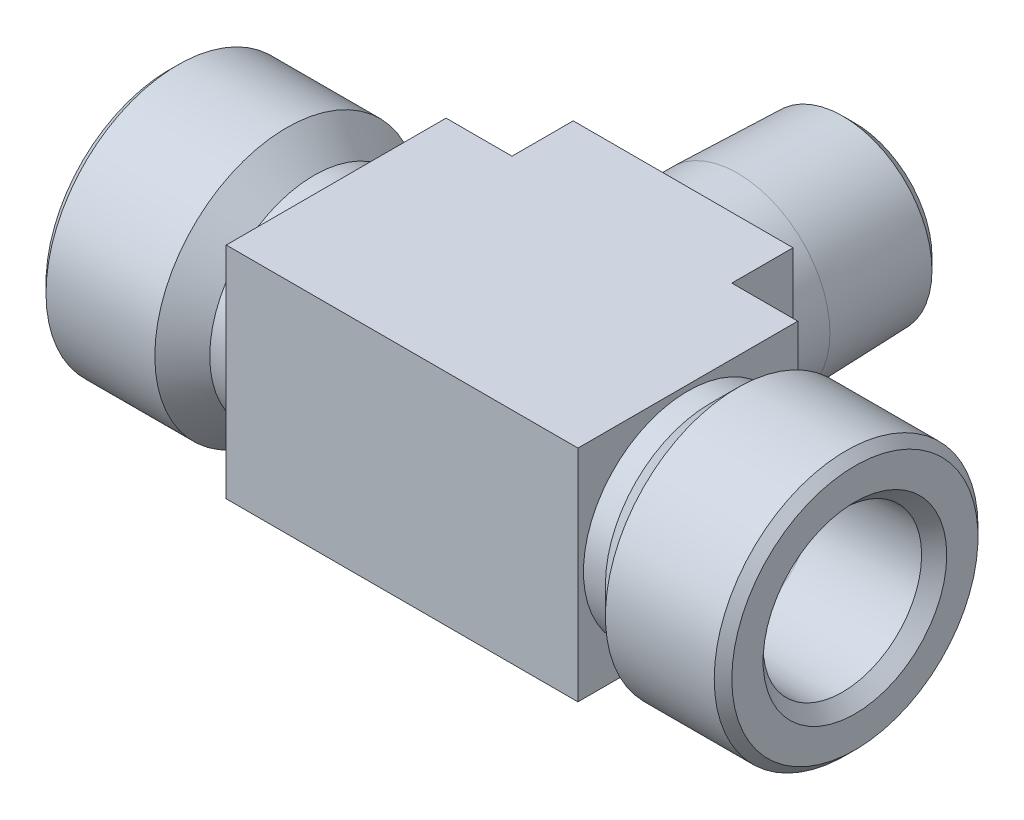
ISO-10303-21;
HEADER;
FILE_DESCRIPTION(('STEP AP214'),'2;1');
FILE_NAME('part.step','',(''),(''),'','','');
FILE_SCHEMA(('AUTOMOTIVE_DESIGN { 1 0 10303 214 1 1 1 1 }'));
ENDSEC;
DATA;
#1=APPLICATION_CONTEXT('core data for automotive mechanical design processes');
#2=APPLICATION_PROTOCOL_DEFINITION('international standard','automotive_design',2000,#1);
#3=PRODUCT_CONTEXT('',#1,'mechanical');
#4=PRODUCT('Part','Part','',(#3));
#5=PRODUCT_RELATED_PRODUCT_CATEGORY('part','',(#4));
#6=PRODUCT_DEFINITION_FORMATION('','',#4);
#7=PRODUCT_DEFINITION_CONTEXT('part definition',#1,'design');
#8=PRODUCT_DEFINITION('design','',#6,#7);
#9=PRODUCT_DEFINITION_SHAPE('','',#8);
#10=(LENGTH_UNIT() NAMED_UNIT(*) SI_UNIT(.MILLI.,.METRE.));
#11=(NAMED_UNIT(*) PLANE_ANGLE_UNIT() SI_UNIT($,.RADIAN.));
#12=(NAMED_UNIT(*) SI_UNIT($,.STERADIAN.) SOLID_ANGLE_UNIT());
#13=UNCERTAINTY_MEASURE_WITH_UNIT(LENGTH_MEASURE(1.E-05),#10,'distance_accuracy_value','');
#14=(GEOMETRIC_REPRESENTATION_CONTEXT(3) GLOBAL_UNCERTAINTY_ASSIGNED_CONTEXT((#13)) GLOBAL_UNIT_ASSIGNED_CONTEXT((#10,
#11,#12)) REPRESENTATION_CONTEXT('',''));
#15=CARTESIAN_POINT('',(0.,0.,0.));
#16=DIRECTION('',(0.,0.,1.));
#17=DIRECTION('',(1.,0.,0.));
#18=AXIS2_PLACEMENT_3D('',#15,#16,#17);
#19=CARTESIAN_POINT('',(19.304,12.7,-12.7));
#20=DIRECTION('',(0.,0.,-1.));
#21=DIRECTION('',(-1.,0.,0.));
#22=AXIS2_PLACEMENT_3D('',#19,#20,#21);
#23=PLANE('',#22);
#24=DIRECTION('',(0.,1.,0.));
#25=VECTOR('',#24,1.);
#26=CARTESIAN_POINT('',(19.304,0.,-12.7));
#27=LINE('',#26,#25);
#28=CARTESIAN_POINT('',(19.304,12.7,-12.7));
#29=VERTEX_POINT('',#28);
#30=CARTESIAN_POINT('',(19.304,-12.7,-12.7));
#31=VERTEX_POINT('',#30);
#32=EDGE_CURVE('E123',#29,#31,#27,.F.);
#33=ORIENTED_EDGE('',*,*,#32,.F.);
#34=DIRECTION('',(1.,0.,0.));
#35=VECTOR('',#34,1.);
#36=CARTESIAN_POINT('',(19.304,12.7,-12.7));
#37=LINE('',#36,#35);
#38=CARTESIAN_POINT('',(26.924,12.7,-12.7));
#39=VERTEX_POINT('',#38);
#40=EDGE_CURVE('E208',#39,#29,#37,.F.);
#41=ORIENTED_EDGE('',*,*,#40,.F.);
#42=DIRECTION('',(0.,1.,0.));
#43=VECTOR('',#42,1.);
#44=CARTESIAN_POINT('',(26.924,12.7,-12.7));
#45=LINE('',#44,#43);
#46=CARTESIAN_POINT('',(26.924,-12.7,-12.7));
#47=VERTEX_POINT('',#46);
#48=EDGE_CURVE('E210',#47,#39,#45,.T.);
#49=ORIENTED_EDGE('',*,*,#48,.F.);
#50=DIRECTION('',(1.,0.,0.));
#51=VECTOR('',#50,1.);
#52=CARTESIAN_POINT('',(19.304,-12.7,-12.7));
#53=LINE('',#52,#51);
#54=EDGE_CURVE('E215',#31,#47,#53,.T.);
#55=ORIENTED_EDGE('',*,*,#54,.F.);
#56=EDGE_LOOP('',(#33,#41,#49,#55));
#57=FACE_BOUND('',#56,.T.);
#58=ADVANCED_FACE('F16',(#57),#23,.T.);
#59=CARTESIAN_POINT('',(19.304,0.,-6.35));
#60=DIRECTION('',(-1.,0.,0.));
#61=DIRECTION('',(0.,0.,1.));
#62=AXIS2_PLACEMENT_3D('',#59,#60,#61);
#63=PLANE('',#62);
#64=DIRECTION('',(0.,0.,1.));
#65=VECTOR('',#64,1.);
#66=CARTESIAN_POINT('',(19.304,12.7,12.7));
#67=LINE('',#66,#65);
#68=CARTESIAN_POINT('',(19.304,12.7,12.7));
#69=VERTEX_POINT('',#68);
#70=EDGE_CURVE('E206',#29,#69,#67,.T.);
#71=ORIENTED_EDGE('',*,*,#70,.F.);
#72=ORIENTED_EDGE('',*,*,#32,.T.);
#73=DIRECTION('',(0.,0.,1.));
#74=VECTOR('',#73,1.);
#75=CARTESIAN_POINT('',(19.304,-12.7,-12.7));
#76=LINE('',#75,#74);
#77=CARTESIAN_POINT('',(19.304,-12.7,12.7));
#78=VERTEX_POINT('',#77);
#79=EDGE_CURVE('E108',#78,#31,#76,.F.);
#80=ORIENTED_EDGE('',*,*,#79,.F.);
#81=DIRECTION('',(0.,-1.,0.));
#82=VECTOR('',#81,1.);
#83=CARTESIAN_POINT('',(19.304,-12.7,12.7));
#84=LINE('',#83,#82);
#85=EDGE_CURVE('E121',#69,#78,#84,.T.);
#86=ORIENTED_EDGE('',*,*,#85,.F.);
#87=EDGE_LOOP('',(#71,#72,#80,#86));
#88=FACE_BOUND('',#87,.T.);
#89=CARTESIAN_POINT('',(19.304,0.,0.));
#90=DIRECTION('',(-1.,0.,0.));
#91=DIRECTION('',(0.,0.,1.));
#92=AXIS2_PLACEMENT_3D('',#89,#90,#91);
#93=CIRCLE('',#92,12.065);
#94=CARTESIAN_POINT('',(19.304,0.,12.065));
#95=VERTEX_POINT('',#94);
#96=EDGE_CURVE('E102',#95,#95,#93,.T.);
#97=ORIENTED_EDGE('',*,*,#96,.F.);
#98=EDGE_LOOP('',(#97));
#99=FACE_BOUND('',#98,.T.);
#100=ADVANCED_FACE('F279',(#88,#99),#63,.T.);
#101=CARTESIAN_POINT('',(19.304,-12.7,12.7));
#102=DIRECTION('',(0.,0.,1.));
#103=DIRECTION('',(0.,-1.,0.));
#104=AXIS2_PLACEMENT_3D('',#101,#102,#103);
#105=PLANE('',#104);
#106=DIRECTION('',(0.,1.,0.));
#107=VECTOR('',#106,1.);
#108=CARTESIAN_POINT('',(59.944,0.,12.7));
#109=LINE('',#108,#107);
#110=CARTESIAN_POINT('',(59.944,12.7,12.7));
#111=VERTEX_POINT('',#110);
#112=CARTESIAN_POINT('',(59.944,-12.7,12.7));
#113=VERTEX_POINT('',#112);
#114=EDGE_CURVE('E79',#111,#113,#109,.F.);
#115=ORIENTED_EDGE('',*,*,#114,.F.);
#116=DIRECTION('',(1.,0.,0.));
#117=VECTOR('',#116,1.);
#118=CARTESIAN_POINT('',(19.304,12.7,12.7));
#119=LINE('',#118,#117);
#120=EDGE_CURVE('E204',#69,#111,#119,.T.);
#121=ORIENTED_EDGE('',*,*,#120,.F.);
#122=ORIENTED_EDGE('',*,*,#85,.T.);
#123=DIRECTION('',(1.,0.,0.));
#124=VECTOR('',#123,1.);
#125=CARTESIAN_POINT('',(19.304,-12.7,12.7));
#126=LINE('',#125,#124);
#127=EDGE_CURVE('E106',#113,#78,#126,.F.);
#128=ORIENTED_EDGE('',*,*,#127,.F.);
#129=EDGE_LOOP('',(#115,#121,#122,#128));
#130=FACE_BOUND('',#129,.T.);
#131=ADVANCED_FACE('F277',(#130),#105,.T.);
#132=CARTESIAN_POINT('',(59.944,0.,-6.35));
#133=DIRECTION('',(1.,0.,0.));
#134=DIRECTION('',(0.,1.,0.));
#135=AXIS2_PLACEMENT_3D('',#132,#133,#134);
#136=PLANE('',#135);
#137=DIRECTION('',(0.,0.,1.));
#138=VECTOR('',#137,1.);
#139=CARTESIAN_POINT('',(59.944,-12.7,-12.7));
#140=LINE('',#139,#138);
#141=CARTESIAN_POINT('',(59.944,-12.7,-12.7));
#142=VERTEX_POINT('',#141);
#143=EDGE_CURVE('E98',#142,#113,#140,.T.);
#144=ORIENTED_EDGE('',*,*,#143,.F.);
#145=DIRECTION('',(0.,1.,0.));
#146=VECTOR('',#145,1.);
#147=CARTESIAN_POINT('',(59.944,12.7,-12.7));
#148=LINE('',#147,#146);
#149=CARTESIAN_POINT('',(59.944,12.7,-12.7));
#150=VERTEX_POINT('',#149);
#151=EDGE_CURVE('E86',#150,#142,#148,.F.);
#152=ORIENTED_EDGE('',*,*,#151,.F.);
#153=DIRECTION('',(0.,0.,1.));
#154=VECTOR('',#153,1.);
#155=CARTESIAN_POINT('',(59.944,12.7,12.7));
#156=LINE('',#155,#154);
#157=EDGE_CURVE('E202',#111,#150,#156,.F.);
#158=ORIENTED_EDGE('',*,*,#157,.F.);
#159=ORIENTED_EDGE('',*,*,#114,.T.);
#160=EDGE_LOOP('',(#144,#152,#158,#159));
#161=FACE_BOUND('',#160,.T.);
#162=CARTESIAN_POINT('',(59.944,0.,0.));
#163=DIRECTION('',(1.,0.,0.));
#164=DIRECTION('',(0.,0.,-1.));
#165=AXIS2_PLACEMENT_3D('',#162,#163,#164);
#166=CIRCLE('',#165,12.065);
#167=CARTESIAN_POINT('',(59.944,0.,-12.065));
#168=VERTEX_POINT('',#167);
#169=EDGE_CURVE('E19',#168,#168,#166,.T.);
#170=ORIENTED_EDGE('',*,*,#169,.F.);
#171=EDGE_LOOP('',(#170));
#172=FACE_BOUND('',#171,.T.);
#173=ADVANCED_FACE('F104',(#161,#172),#136,.T.);
#174=CARTESIAN_POINT('',(19.304,12.7,-12.7));
#175=DIRECTION('',(0.,0.,-1.));
#176=DIRECTION('',(-1.,0.,0.));
#177=AXIS2_PLACEMENT_3D('',#174,#175,#176);
#178=PLANE('',#177);
#179=ORIENTED_EDGE('',*,*,#151,.T.);
#180=DIRECTION('',(1.,0.,0.));
#181=VECTOR('',#180,1.);
#182=CARTESIAN_POINT('',(19.304,-12.7,-12.7));
#183=LINE('',#182,#181);
#184=CARTESIAN_POINT('',(52.324,-12.7,-12.7));
#185=VERTEX_POINT('',#184);
#186=EDGE_CURVE('E90',#185,#142,#183,.T.);
#187=ORIENTED_EDGE('',*,*,#186,.F.);
#188=DIRECTION('',(0.,1.,0.));
#189=VECTOR('',#188,1.);
#190=CARTESIAN_POINT('',(52.324,-12.7,-12.7));
#191=LINE('',#190,#189);
#192=CARTESIAN_POINT('',(52.324,12.7,-12.7));
#193=VERTEX_POINT('',#192);
#194=EDGE_CURVE('E196',#193,#185,#191,.F.);
#195=ORIENTED_EDGE('',*,*,#194,.F.);
#196=DIRECTION('',(1.,0.,0.));
#197=VECTOR('',#196,1.);
#198=CARTESIAN_POINT('',(19.304,12.7,-12.7));
#199=LINE('',#198,#197);
#200=EDGE_CURVE('E92',#150,#193,#199,.F.);
#201=ORIENTED_EDGE('',*,*,#200,.F.);
#202=EDGE_LOOP('',(#179,#187,#195,#201));
#203=FACE_BOUND('',#202,.T.);
#204=ADVANCED_FACE('F88',(#203),#178,.T.);
#205=CARTESIAN_POINT('',(61.214,0.,0.));
#206=DIRECTION('',(1.,0.,0.));
#207=DIRECTION('',(0.,0.,-1.));
#208=AXIS2_PLACEMENT_3D('',#205,#206,#207);
#209=CYLINDRICAL_SURFACE('',#208,12.065);
#210=ORIENTED_EDGE('',*,*,#169,.T.);
#211=EDGE_LOOP('',(#210));
#212=FACE_BOUND('',#211,.T.);
#213=CARTESIAN_POINT('',(62.484,0.,0.));
#214=DIRECTION('',(1.,0.,0.));
#215=DIRECTION('',(0.,0.,1.));
#216=AXIS2_PLACEMENT_3D('',#213,#214,#215);
#217=CIRCLE('',#216,12.065);
#218=CARTESIAN_POINT('',(62.484,0.,12.065));
#219=VERTEX_POINT('',#218);
#220=EDGE_CURVE('E116',#219,#219,#217,.F.);
#221=ORIENTED_EDGE('',*,*,#220,.T.);
#222=EDGE_LOOP('',(#221));
#223=FACE_BOUND('',#222,.T.);
#224=ADVANCED_FACE('F268',(#212,#223),#209,.T.);
#225=CARTESIAN_POINT('',(18.034,0.,0.));
#226=DIRECTION('',(-1.,0.,0.));
#227=DIRECTION('',(0.,0.,1.));
#228=AXIS2_PLACEMENT_3D('',#225,#226,#227);
#229=CYLINDRICAL_SURFACE('',#228,12.065);
#230=ORIENTED_EDGE('',*,*,#96,.T.);
#231=EDGE_LOOP('',(#230));
#232=FACE_BOUND('',#231,.T.);
#233=CARTESIAN_POINT('',(16.764,0.,0.));
#234=DIRECTION('',(-1.,0.,0.));
#235=DIRECTION('',(0.,0.,-1.));
#236=AXIS2_PLACEMENT_3D('',#233,#234,#235);
#237=CIRCLE('',#236,12.065);
#238=CARTESIAN_POINT('',(16.764,0.,-12.065));
#239=VERTEX_POINT('',#238);
#240=EDGE_CURVE('E112',#239,#239,#237,.F.);
#241=ORIENTED_EDGE('',*,*,#240,.T.);
#242=EDGE_LOOP('',(#241));
#243=FACE_BOUND('',#242,.T.);
#244=ADVANCED_FACE('F265',(#232,#243),#229,.T.);
#245=CARTESIAN_POINT('',(19.304,-12.7,-12.7));
#246=DIRECTION('',(0.,-1.,0.));
#247=DIRECTION('',(1.,0.,0.));
#248=AXIS2_PLACEMENT_3D('',#245,#246,#247);
#249=PLANE('',#248);
#250=ORIENTED_EDGE('',*,*,#79,.T.);
#251=ORIENTED_EDGE('',*,*,#54,.T.);
#252=DIRECTION('',(0.,0.,1.));
#253=VECTOR('',#252,1.);
#254=CARTESIAN_POINT('',(26.924,-12.7,0.));
#255=LINE('',#254,#253);
#256=CARTESIAN_POINT('',(26.924,-12.7,-19.7739));
#257=VERTEX_POINT('',#256);
#258=EDGE_CURVE('E212',#257,#47,#255,.T.);
#259=ORIENTED_EDGE('',*,*,#258,.F.);
#260=DIRECTION('',(-1.,0.,0.));
#261=VECTOR('',#260,1.);
#262=CARTESIAN_POINT('',(45.974,-12.7,-19.7739));
#263=LINE('',#262,#261);
#264=CARTESIAN_POINT('',(52.324,-12.7,-19.7739));
#265=VERTEX_POINT('',#264);
#266=EDGE_CURVE('E115',#265,#257,#263,.T.);
#267=ORIENTED_EDGE('',*,*,#266,.F.);
#268=DIRECTION('',(0.,0.,-1.));
#269=VECTOR('',#268,1.);
#270=CARTESIAN_POINT('',(52.324,-12.7,0.));
#271=LINE('',#270,#269);
#272=EDGE_CURVE('E101',#185,#265,#271,.T.);
#273=ORIENTED_EDGE('',*,*,#272,.F.);
#274=ORIENTED_EDGE('',*,*,#186,.T.);
#275=ORIENTED_EDGE('',*,*,#143,.T.);
#276=ORIENTED_EDGE('',*,*,#127,.T.);
#277=EDGE_LOOP('',(#250,#251,#259,#267,#273,#274,#275,#276));
#278=FACE_BOUND('',#277,.T.);
#279=ADVANCED_FACE('F96',(#278),#249,.T.);
#280=CARTESIAN_POINT('',(26.924,12.7,0.));
#281=DIRECTION('',(-1.,0.,0.));
#282=DIRECTION('',(0.,0.,1.));
#283=AXIS2_PLACEMENT_3D('',#280,#281,#282);
#284=PLANE('',#283);
#285=ORIENTED_EDGE('',*,*,#48,.T.);
#286=DIRECTION('',(0.,0.,1.));
#287=VECTOR('',#286,1.);
#288=CARTESIAN_POINT('',(26.924,12.7,12.7));
#289=LINE('',#288,#287);
#290=CARTESIAN_POINT('',(26.924,12.7,-19.7739));
#291=VERTEX_POINT('',#290);
#292=EDGE_CURVE('E198',#291,#39,#289,.T.);
#293=ORIENTED_EDGE('',*,*,#292,.F.);
#294=DIRECTION('',(0.,1.,0.));
#295=VECTOR('',#294,1.);
#296=CARTESIAN_POINT('',(26.924,0.,-19.7739));
#297=LINE('',#296,#295);
#298=EDGE_CURVE('E185',#257,#291,#297,.T.);
#299=ORIENTED_EDGE('',*,*,#298,.F.);
#300=ORIENTED_EDGE('',*,*,#258,.T.);
#301=EDGE_LOOP('',(#285,#293,#299,#300));
#302=FACE_BOUND('',#301,.T.);
#303=ADVANCED_FACE('F228',(#302),#284,.T.);
#304=CARTESIAN_POINT('',(19.304,12.7,12.7));
#305=DIRECTION('',(0.,1.,0.));
#306=DIRECTION('',(0.,0.,1.));
#307=AXIS2_PLACEMENT_3D('',#304,#305,#306);
#308=PLANE('',#307);
#309=DIRECTION('',(-1.,0.,0.));
#310=VECTOR('',#309,1.);
#311=CARTESIAN_POINT('',(45.974,12.7,-19.7739));
#312=LINE('',#311,#310);
#313=CARTESIAN_POINT('',(52.324,12.7,-19.7739));
#314=VERTEX_POINT('',#313);
#315=EDGE_CURVE('E34',#291,#314,#312,.F.);
#316=ORIENTED_EDGE('',*,*,#315,.F.);
#317=ORIENTED_EDGE('',*,*,#292,.T.);
#318=ORIENTED_EDGE('',*,*,#40,.T.);
#319=ORIENTED_EDGE('',*,*,#70,.T.);
#320=ORIENTED_EDGE('',*,*,#120,.T.);
#321=ORIENTED_EDGE('',*,*,#157,.T.);
#322=ORIENTED_EDGE('',*,*,#200,.T.);
#323=DIRECTION('',(0.,0.,-1.));
#324=VECTOR('',#323,1.);
#325=CARTESIAN_POINT('',(52.324,12.7,0.));
#326=LINE('',#325,#324);
#327=EDGE_CURVE('E118',#314,#193,#326,.F.);
#328=ORIENTED_EDGE('',*,*,#327,.F.);
#329=EDGE_LOOP('',(#316,#317,#318,#319,#320,#321,#322,#328));
#330=FACE_BOUND('',#329,.T.);
#331=ADVANCED_FACE('F231',(#330),#308,.T.);
#332=CARTESIAN_POINT('',(52.324,-12.7,0.));
#333=DIRECTION('',(1.,0.,0.));
#334=DIRECTION('',(0.,0.,-1.));
#335=AXIS2_PLACEMENT_3D('',#332,#333,#334);
#336=PLANE('',#335);
#337=DIRECTION('',(0.,1.,0.));
#338=VECTOR('',#337,1.);
#339=CARTESIAN_POINT('',(52.324,0.,-19.7739));
#340=LINE('',#339,#338);
#341=EDGE_CURVE('E181',#314,#265,#340,.F.);
#342=ORIENTED_EDGE('',*,*,#341,.F.);
#343=ORIENTED_EDGE('',*,*,#327,.T.);
#344=ORIENTED_EDGE('',*,*,#194,.T.);
#345=ORIENTED_EDGE('',*,*,#272,.T.);
#346=EDGE_LOOP('',(#342,#343,#344,#345));
#347=FACE_BOUND('',#346,.T.);
#348=ADVANCED_FACE('F234',(#347),#336,.T.);
#349=CARTESIAN_POINT('',(62.484,0.,0.));
#350=DIRECTION('',(1.,0.,0.));
#351=DIRECTION('',(0.,1.,0.));
#352=AXIS2_PLACEMENT_3D('',#349,#350,#351);
#353=CONICAL_SURFACE('',#352,12.065,0.785398163397448);
#354=ORIENTED_EDGE('',*,*,#220,.F.);
#355=EDGE_LOOP('',(#354));
#356=FACE_BOUND('',#355,.T.);
#357=CARTESIAN_POINT('',(65.659,0.,0.));
#358=DIRECTION('',(1.,0.,0.));
#359=DIRECTION('',(0.,0.,-1.));
#360=AXIS2_PLACEMENT_3D('',#357,#358,#359);
#361=CIRCLE('',#360,15.24);
#362=CARTESIAN_POINT('',(65.659,0.,-15.24));
#363=VERTEX_POINT('',#362);
#364=EDGE_CURVE('E183',#363,#363,#361,.T.);
#365=ORIENTED_EDGE('',*,*,#364,.F.);
#366=EDGE_LOOP('',(#365));
#367=FACE_BOUND('',#366,.T.);
#368=ADVANCED_FACE('F248',(#356,#367),#353,.T.);
#369=CARTESIAN_POINT('',(16.764,0.,0.));
#370=DIRECTION('',(-1.,0.,0.));
#371=DIRECTION('',(0.,0.,1.));
#372=AXIS2_PLACEMENT_3D('',#369,#370,#371);
#373=CONICAL_SURFACE('',#372,12.065,0.785398163397448);
#374=ORIENTED_EDGE('',*,*,#240,.F.);
#375=EDGE_LOOP('',(#374));
#376=FACE_BOUND('',#375,.T.);
#377=CARTESIAN_POINT('',(13.589,0.,0.));
#378=DIRECTION('',(-1.,0.,0.));
#379=DIRECTION('',(0.,0.,1.));
#380=AXIS2_PLACEMENT_3D('',#377,#378,#379);
#381=CIRCLE('',#380,15.24);
#382=CARTESIAN_POINT('',(13.589,0.,15.24));
#383=VERTEX_POINT('',#382);
#384=EDGE_CURVE('E188',#383,#383,#381,.T.);
#385=ORIENTED_EDGE('',*,*,#384,.F.);
#386=EDGE_LOOP('',(#385));
#387=FACE_BOUND('',#386,.T.);
#388=ADVANCED_FACE('F238',(#376,#387),#373,.T.);
#389=CARTESIAN_POINT('',(45.974,0.,-19.7739));
#390=DIRECTION('',(0.,0.,-1.));
#391=DIRECTION('',(-1.,0.,0.));
#392=AXIS2_PLACEMENT_3D('',#389,#390,#391);
#393=PLANE('',#392);
#394=CARTESIAN_POINT('',(39.624,0.,-19.7739));
#395=DIRECTION('',(0.,0.,1.));
#396=DIRECTION('',(1.,0.,0.));
#397=AXIS2_PLACEMENT_3D('',#394,#395,#396);
#398=CIRCLE('',#397,10.668);
#399=CARTESIAN_POINT('',(50.292,0.,-19.7739));
#400=VERTEX_POINT('',#399);
#401=EDGE_CURVE('E180',#400,#400,#398,.F.);
#402=ORIENTED_EDGE('',*,*,#401,.F.);
#403=EDGE_LOOP('',(#402));
#404=FACE_BOUND('',#403,.T.);
#405=ORIENTED_EDGE('',*,*,#315,.T.);
#406=ORIENTED_EDGE('',*,*,#341,.T.);
#407=ORIENTED_EDGE('',*,*,#266,.T.);
#408=ORIENTED_EDGE('',*,*,#298,.T.);
#409=EDGE_LOOP('',(#405,#406,#407,#408));
#410=FACE_BOUND('',#409,.T.);
#411=ADVANCED_FACE('F235',(#404,#410),#393,.T.);
#412=CARTESIAN_POINT('',(70.866,0.,0.));
#413=DIRECTION('',(1.,0.,0.));
#414=DIRECTION('',(0.,0.,-1.));
#415=AXIS2_PLACEMENT_3D('',#412,#413,#414);
#416=CYLINDRICAL_SURFACE('',#415,15.24);
#417=ORIENTED_EDGE('',*,*,#364,.T.);
#418=EDGE_LOOP('',(#417));
#419=FACE_BOUND('',#418,.T.);
#420=CARTESIAN_POINT('',(78.232,0.,0.));
#421=DIRECTION('',(-1.,0.,0.));
#422=DIRECTION('',(0.,0.,-1.));
#423=AXIS2_PLACEMENT_3D('',#420,#421,#422);
#424=CIRCLE('',#423,15.24);
#425=CARTESIAN_POINT('',(78.232,0.,-15.24));
#426=VERTEX_POINT('',#425);
#427=EDGE_CURVE('E177',#426,#426,#424,.T.);
#428=ORIENTED_EDGE('',*,*,#427,.T.);
#429=EDGE_LOOP('',(#428));
#430=FACE_BOUND('',#429,.T.);
#431=ADVANCED_FACE('F237',(#419,#430),#416,.T.);
#432=CARTESIAN_POINT('',(8.382,0.,0.));
#433=DIRECTION('',(-1.,0.,0.));
#434=DIRECTION('',(0.,0.,1.));
#435=AXIS2_PLACEMENT_3D('',#432,#433,#434);
#436=CYLINDRICAL_SURFACE('',#435,15.24);
#437=ORIENTED_EDGE('',*,*,#384,.T.);
#438=EDGE_LOOP('',(#437));
#439=FACE_BOUND('',#438,.T.);
#440=CARTESIAN_POINT('',(1.016,0.,0.));
#441=DIRECTION('',(1.,0.,0.));
#442=DIRECTION('',(0.,0.,1.));
#443=AXIS2_PLACEMENT_3D('',#440,#441,#442);
#444=CIRCLE('',#443,15.24);
#445=CARTESIAN_POINT('',(1.016,0.,15.24));
#446=VERTEX_POINT('',#445);
#447=EDGE_CURVE('E174',#446,#446,#444,.T.);
#448=ORIENTED_EDGE('',*,*,#447,.T.);
#449=EDGE_LOOP('',(#448));
#450=FACE_BOUND('',#449,.T.);
#451=ADVANCED_FACE('F245',(#439,#450),#436,.T.);
#452=CARTESIAN_POINT('',(39.624,0.,-22.92096));
#453=DIRECTION('',(0.,0.,1.));
#454=DIRECTION('',(1.,0.,0.));
#455=AXIS2_PLACEMENT_3D('',#452,#453,#454);
#456=CYLINDRICAL_SURFACE('',#455,10.668);
#457=CARTESIAN_POINT('',(39.624,0.,-26.06802));
#458=DIRECTION('',(0.,0.,1.));
#459=DIRECTION('',(-1.,0.,0.));
#460=AXIS2_PLACEMENT_3D('',#457,#458,#459);
#461=CIRCLE('',#460,10.668);
#462=CARTESIAN_POINT('',(28.956,0.,-26.0680199999999));
#463=VERTEX_POINT('',#462);
#464=EDGE_CURVE('E170',#463,#463,#461,.F.);
#465=ORIENTED_EDGE('',*,*,#464,.F.);
#466=EDGE_LOOP('',(#465));
#467=FACE_BOUND('',#466,.T.);
#468=ORIENTED_EDGE('',*,*,#401,.T.);
#469=EDGE_LOOP('',(#468));
#470=FACE_BOUND('',#469,.T.);
#471=ADVANCED_FACE('F322',(#467,#470),#456,.T.);
#472=CARTESIAN_POINT('',(79.248,0.,0.));
#473=DIRECTION('',(-1.,0.,0.));
#474=DIRECTION('',(0.,0.,1.));
#475=AXIS2_PLACEMENT_3D('',#472,#473,#474);
#476=CONICAL_SURFACE('',#475,14.224,0.785398163397448);
#477=CARTESIAN_POINT('',(79.248,0.,0.));
#478=DIRECTION('',(-1.,0.,0.));
#479=DIRECTION('',(0.,0.,1.));
#480=AXIS2_PLACEMENT_3D('',#477,#478,#479);
#481=CIRCLE('',#480,14.224);
#482=CARTESIAN_POINT('',(79.248,0.,14.224));
#483=VERTEX_POINT('',#482);
#484=EDGE_CURVE('E173',#483,#483,#481,.F.);
#485=ORIENTED_EDGE('',*,*,#484,.F.);
#486=EDGE_LOOP('',(#485));
#487=FACE_BOUND('',#486,.T.);
#488=ORIENTED_EDGE('',*,*,#427,.F.);
#489=EDGE_LOOP('',(#488));
#490=FACE_BOUND('',#489,.T.);
#491=ADVANCED_FACE('F325',(#487,#490),#476,.T.);
#492=CARTESIAN_POINT('',(0.,0.,0.));
#493=DIRECTION('',(1.,0.,0.));
#494=DIRECTION('',(0.,0.,-1.));
#495=AXIS2_PLACEMENT_3D('',#492,#493,#494);
#496=CONICAL_SURFACE('',#495,14.224,0.785398163397449);
#497=CARTESIAN_POINT('',(0.,0.,0.));
#498=DIRECTION('',(1.,0.,0.));
#499=DIRECTION('',(0.,0.,-1.));
#500=AXIS2_PLACEMENT_3D('',#497,#498,#499);
#501=CIRCLE('',#500,14.224);
#502=CARTESIAN_POINT('',(0.,0.,-14.224));
#503=VERTEX_POINT('',#502);
#504=EDGE_CURVE('E169',#503,#503,#501,.F.);
#505=ORIENTED_EDGE('',*,*,#504,.F.);
#506=EDGE_LOOP('',(#505));
#507=FACE_BOUND('',#506,.T.);
#508=ORIENTED_EDGE('',*,*,#447,.F.);
#509=EDGE_LOOP('',(#508));
#510=FACE_BOUND('',#509,.T.);
#511=ADVANCED_FACE('F318',(#507,#510),#496,.T.);
#512=CARTESIAN_POINT('',(39.624,0.,-26.0680199999999));
#513=DIRECTION('',(0.,0.,1.));
#514=DIRECTION('',(1.,0.,0.));
#515=AXIS2_PLACEMENT_3D('',#512,#513,#514);
#516=CONICAL_SURFACE('',#515,10.668,0.0311250383214153);
#517=CARTESIAN_POINT('',(39.624,0.,-38.2415334766456));
#518=DIRECTION('',(0.,0.,1.));
#519=DIRECTION('',(-1.,0.,0.));
#520=AXIS2_PLACEMENT_3D('',#517,#518,#519);
#521=CIRCLE('',#520,10.2889765233544);
#522=CARTESIAN_POINT('',(29.3350234766456,0.,-38.2415334766456));
#523=VERTEX_POINT('',#522);
#524=EDGE_CURVE('E165',#523,#523,#521,.T.);
#525=ORIENTED_EDGE('',*,*,#524,.T.);
#526=EDGE_LOOP('',(#525));
#527=FACE_BOUND('',#526,.T.);
#528=ORIENTED_EDGE('',*,*,#464,.T.);
#529=EDGE_LOOP('',(#528));
#530=FACE_BOUND('',#529,.T.);
#531=ADVANCED_FACE('F314',(#527,#530),#516,.T.);
#532=CARTESIAN_POINT('',(79.248,0.,7.62));
#533=DIRECTION('',(1.,0.,0.));
#534=DIRECTION('',(0.,0.,-1.));
#535=AXIS2_PLACEMENT_3D('',#532,#533,#534);
#536=PLANE('',#535);
#537=CARTESIAN_POINT('',(79.248,0.,0.));
#538=DIRECTION('',(1.,0.,0.));
#539=DIRECTION('',(0.,0.,-1.));
#540=AXIS2_PLACEMENT_3D('',#537,#538,#539);
#541=CIRCLE('',#540,10.611739);
#542=CARTESIAN_POINT('',(79.248,0.,-10.611739));
#543=VERTEX_POINT('',#542);
#544=EDGE_CURVE('E168',#543,#543,#541,.F.);
#545=ORIENTED_EDGE('',*,*,#544,.T.);
#546=EDGE_LOOP('',(#545));
#547=FACE_BOUND('',#546,.T.);
#548=ORIENTED_EDGE('',*,*,#484,.T.);
#549=EDGE_LOOP('',(#548));
#550=FACE_BOUND('',#549,.T.);
#551=ADVANCED_FACE('F317',(#547,#550),#536,.T.);
#552=CARTESIAN_POINT('',(0.,0.,-7.62));
#553=DIRECTION('',(-1.,0.,0.));
#554=DIRECTION('',(0.,0.,1.));
#555=AXIS2_PLACEMENT_3D('',#552,#553,#554);
#556=PLANE('',#555);
#557=CARTESIAN_POINT('',(0.,0.,0.));
#558=DIRECTION('',(-1.,0.,0.));
#559=DIRECTION('',(0.,0.,1.));
#560=AXIS2_PLACEMENT_3D('',#557,#558,#559);
#561=CIRCLE('',#560,10.611739);
#562=CARTESIAN_POINT('',(0.,0.,10.611739));
#563=VERTEX_POINT('',#562);
#564=EDGE_CURVE('E298',#563,#563,#561,.F.);
#565=ORIENTED_EDGE('',*,*,#564,.T.);
#566=EDGE_LOOP('',(#565));
#567=FACE_BOUND('',#566,.T.);
#568=ORIENTED_EDGE('',*,*,#504,.T.);
#569=EDGE_LOOP('',(#568));
#570=FACE_BOUND('',#569,.T.);
#571=ADVANCED_FACE('F310',(#567,#570),#556,.T.);
#572=CARTESIAN_POINT('',(39.624,0.,-39.624));
#573=DIRECTION('',(0.,0.,1.));
#574=DIRECTION('',(1.,0.,0.));
#575=AXIS2_PLACEMENT_3D('',#572,#573,#574);
#576=CONICAL_SURFACE('',#575,8.90650999999998,0.785398163397446);
#577=CARTESIAN_POINT('',(39.624,0.,-39.624));
#578=DIRECTION('',(0.,0.,1.));
#579=DIRECTION('',(1.,0.,0.));
#580=AXIS2_PLACEMENT_3D('',#577,#578,#579);
#581=CIRCLE('',#580,8.90650999999999);
#582=CARTESIAN_POINT('',(48.53051,0.,-39.624));
#583=VERTEX_POINT('',#582);
#584=EDGE_CURVE('E164',#583,#583,#581,.F.);
#585=ORIENTED_EDGE('',*,*,#584,.F.);
#586=EDGE_LOOP('',(#585));
#587=FACE_BOUND('',#586,.T.);
#588=ORIENTED_EDGE('',*,*,#524,.F.);
#589=EDGE_LOOP('',(#588));
#590=FACE_BOUND('',#589,.T.);
#591=ADVANCED_FACE('F306',(#587,#590),#576,.T.);
#592=CARTESIAN_POINT('',(79.248,0.,0.));
#593=DIRECTION('',(1.,0.,0.));
#594=DIRECTION('',(0.,0.,-1.));
#595=AXIS2_PLACEMENT_3D('',#592,#593,#594);
#596=CONICAL_SURFACE('',#595,10.611739,0.785398163397448);
#597=ORIENTED_EDGE('',*,*,#544,.F.);
#598=EDGE_LOOP('',(#597));
#599=FACE_BOUND('',#598,.T.);
#600=CARTESIAN_POINT('',(77.796644,0.,0.));
#601=DIRECTION('',(1.,0.,0.));
#602=DIRECTION('',(0.,0.,1.));
#603=AXIS2_PLACEMENT_3D('',#600,#601,#602);
#604=CIRCLE('',#603,9.160383);
#605=CARTESIAN_POINT('',(77.796644,0.,9.160383));
#606=VERTEX_POINT('',#605);
#607=EDGE_CURVE('E161',#606,#606,#604,.F.);
#608=ORIENTED_EDGE('',*,*,#607,.T.);
#609=EDGE_LOOP('',(#608));
#610=FACE_BOUND('',#609,.T.);
#611=ADVANCED_FACE('F309',(#599,#610),#596,.F.);
#612=CARTESIAN_POINT('',(0.,0.,0.));
#613=DIRECTION('',(-1.,0.,0.));
#614=DIRECTION('',(0.,0.,1.));
#615=AXIS2_PLACEMENT_3D('',#612,#613,#614);
#616=CONICAL_SURFACE('',#615,10.611739,0.785398163397449);
#617=ORIENTED_EDGE('',*,*,#564,.F.);
#618=EDGE_LOOP('',(#617));
#619=FACE_BOUND('',#618,.T.);
#620=CARTESIAN_POINT('',(1.45135600000001,0.,0.));
#621=DIRECTION('',(-1.,0.,0.));
#622=DIRECTION('',(0.,0.,-1.));
#623=AXIS2_PLACEMENT_3D('',#620,#621,#622);
#624=CIRCLE('',#623,9.160383);
#625=CARTESIAN_POINT('',(1.45135600000003,0.,-9.160383));
#626=VERTEX_POINT('',#625);
#627=EDGE_CURVE('E157',#626,#626,#624,.F.);
#628=ORIENTED_EDGE('',*,*,#627,.T.);
#629=EDGE_LOOP('',(#628));
#630=FACE_BOUND('',#629,.T.);
#631=ADVANCED_FACE('F346',(#619,#630),#616,.F.);
#632=CARTESIAN_POINT('',(34.5010333503468,0.,-39.624));
#633=DIRECTION('',(0.,0.,-1.));
#634=DIRECTION('',(-1.,0.,0.));
#635=AXIS2_PLACEMENT_3D('',#632,#633,#634);
#636=PLANE('',#635);
#637=ORIENTED_EDGE('',*,*,#584,.T.);
#638=EDGE_LOOP('',(#637));
#639=FACE_BOUND('',#638,.T.);
#640=CARTESIAN_POINT('',(39.624,0.,-39.624));
#641=DIRECTION('',(0.,0.,-1.));
#642=DIRECTION('',(-1.,0.,0.));
#643=AXIS2_PLACEMENT_3D('',#640,#641,#642);
#644=CIRCLE('',#643,5.969);
#645=CARTESIAN_POINT('',(33.655,0.,-39.624));
#646=VERTEX_POINT('',#645);
#647=EDGE_CURVE('E130',#646,#646,#644,.F.);
#648=ORIENTED_EDGE('',*,*,#647,.T.);
#649=EDGE_LOOP('',(#648));
#650=FACE_BOUND('',#649,.T.);
#651=ADVANCED_FACE('F303',(#639,#650),#636,.T.);
#652=CARTESIAN_POINT('',(77.796644,0.,0.));
#653=DIRECTION('',(1.,0.,0.));
#654=DIRECTION('',(0.,1.,0.));
#655=AXIS2_PLACEMENT_3D('',#652,#653,#654);
#656=CONICAL_SURFACE('',#655,9.160383,0.0256563400043167);
#657=ORIENTED_EDGE('',*,*,#607,.F.);
#658=EDGE_LOOP('',(#657));
#659=FACE_BOUND('',#658,.T.);
#660=CARTESIAN_POINT('',(65.67678,0.,0.));
#661=DIRECTION('',(1.,0.,0.));
#662=DIRECTION('',(0.,0.,-1.));
#663=AXIS2_PLACEMENT_3D('',#660,#661,#662);
#664=CIRCLE('',#663,8.84936340276164);
#665=CARTESIAN_POINT('',(65.67678,0.,-8.84936340276164));
#666=VERTEX_POINT('',#665);
#667=EDGE_CURVE('E152',#666,#666,#664,.F.);
#668=ORIENTED_EDGE('',*,*,#667,.T.);
#669=EDGE_LOOP('',(#668));
#670=FACE_BOUND('',#669,.T.);
#671=ADVANCED_FACE('F353',(#659,#670),#656,.F.);
#672=CARTESIAN_POINT('',(1.45135600000003,0.,0.));
#673=DIRECTION('',(-1.,0.,0.));
#674=DIRECTION('',(0.,0.,1.));
#675=AXIS2_PLACEMENT_3D('',#672,#673,#674);
#676=CONICAL_SURFACE('',#675,9.160383,0.0256563400043167);
#677=ORIENTED_EDGE('',*,*,#627,.F.);
#678=EDGE_LOOP('',(#677));
#679=FACE_BOUND('',#678,.T.);
#680=CARTESIAN_POINT('',(13.57122,0.,0.));
#681=DIRECTION('',(1.,0.,0.));
#682=DIRECTION('',(0.,0.,-1.));
#683=AXIS2_PLACEMENT_3D('',#680,#681,#682);
#684=CIRCLE('',#683,8.84936340276164);
#685=CARTESIAN_POINT('',(13.57122,0.,-8.84936340276164));
#686=VERTEX_POINT('',#685);
#687=EDGE_CURVE('E25',#686,#686,#684,.T.);
#688=ORIENTED_EDGE('',*,*,#687,.T.);
#689=EDGE_LOOP('',(#688));
#690=FACE_BOUND('',#689,.T.);
#691=ADVANCED_FACE('F143',(#679,#690),#676,.F.);
#692=CARTESIAN_POINT('',(39.624,0.,-29.69895));
#693=DIRECTION('',(0.,0.,-1.));
#694=DIRECTION('',(-1.,0.,0.));
#695=AXIS2_PLACEMENT_3D('',#692,#693,#694);
#696=CYLINDRICAL_SURFACE('',#695,5.969);
#697=CARTESIAN_POINT('',(33.655,0.,-8.84936340276164));
#698=CARTESIAN_POINT('',(33.6550010497407,-0.149412195864291,-8.84936240659858));
#699=CARTESIAN_POINT('',(33.6606186574489,-0.298844438144,-8.84557056085226));
#700=CARTESIAN_POINT('',(33.6830077161083,-0.596550767939231,-8.83049229194922));
#701=CARTESIAN_POINT('',(33.6997847645318,-0.7448242364436,-8.8192021076996));
#702=CARTESIAN_POINT('',(33.7442745318537,-1.0392239530072,-8.78937826407328));
#703=CARTESIAN_POINT('',(33.7720047595038,-1.18534637276874,-8.77083300785793));
#704=CARTESIAN_POINT('',(33.8380117351089,-1.47419944132437,-8.72693103813553));
#705=CARTESIAN_POINT('',(33.8762930439904,-1.61692859425842,-8.70157137907888));
#706=CARTESIAN_POINT('',(33.9626403878469,-1.89719218392584,-8.64477943236778));
#707=CARTESIAN_POINT('',(34.0106473078165,-2.03475231910018,-8.61338388870201));
#708=CARTESIAN_POINT('',(34.1160327236673,-2.30484284377991,-8.54507887418182));
#709=CARTESIAN_POINT('',(34.1734148751607,-2.43737124635901,-8.50816725296659));
#710=CARTESIAN_POINT('',(34.3586904562011,-2.82626916310391,-8.39026923935097));
#711=CARTESIAN_POINT('',(34.4998188797828,-3.0742895109636,-8.30204851949013));
#712=CARTESIAN_POINT('',(34.8262953302757,-3.56443374233779,-8.104437539783));
#713=CARTESIAN_POINT('',(35.0144005354353,-3.80422084447112,-7.99387975806055));
#714=CARTESIAN_POINT('',(35.4229848412859,-4.25114470518828,-7.76543546468391));
#715=CARTESIAN_POINT('',(35.6435113192781,-4.45823274608144,-7.64753837597144));
#716=CARTESIAN_POINT('',(36.0151958586872,-4.75775815505123,-7.46269157914069));
#717=CARTESIAN_POINT('',(36.1567446772892,-4.86189859819042,-7.39507595764872));
#718=CARTESIAN_POINT('',(36.449328785284,-5.05781187591269,-7.26249118905015));
#719=CARTESIAN_POINT('',(36.6003663738249,-5.14958169599233,-7.19752268968217));
#720=CARTESIAN_POINT('',(37.0668717843116,-5.40513630939351,-7.01000230046146));
#721=CARTESIAN_POINT('',(37.3963840557577,-5.54969506394713,-6.89449256893739));
#722=CARTESIAN_POINT('',(37.9869812115975,-5.74594851462214,-6.73103542021308));
#723=CARTESIAN_POINT('',(38.2404016873927,-5.81240095660639,-6.67321056608848));
#724=CARTESIAN_POINT('',(38.6284264120609,-5.88686129721407,-6.60735460446265));
#725=CARTESIAN_POINT('',(38.7589247216393,-5.90746883039513,-6.5888923791757));
#726=CARTESIAN_POINT('',(39.0218102694279,-5.94001940286927,-6.55956582284525));
#727=CARTESIAN_POINT('',(39.1541962660698,-5.95196789155536,-6.54869671338463));
#728=CARTESIAN_POINT('',(39.3430564106835,-5.96264968075735,-6.53896426658037));
#729=CARTESIAN_POINT('',(39.3991888553223,-5.9650296329355,-6.53679272132896));
#730=CARTESIAN_POINT('',(39.5115445431396,-5.96820526962659,-6.53389338724208));
#731=CARTESIAN_POINT('',(39.5677677997829,-5.96900069242103,-6.53316583691296));
#732=CARTESIAN_POINT('',(39.7689552529725,-5.96899821507847,-6.53317015818109));
#733=CARTESIAN_POINT('',(39.9139699363728,-5.96370621071299,-6.5380159003974));
#734=CARTESIAN_POINT('',(40.2026768143078,-5.9426491033732,-6.5571600702876));
#735=CARTESIAN_POINT('',(40.3463678875946,-5.92687582460336,-6.57146587713202));
#736=CARTESIAN_POINT('',(40.6314930574459,-5.88512761348161,-6.60887953928602));
#737=CARTESIAN_POINT('',(40.7729200556225,-5.85912539503854,-6.63201093217571));
#738=CARTESIAN_POINT('',(41.0521499706205,-5.79739870591357,-6.68603608803157));
#739=CARTESIAN_POINT('',(41.1899508579621,-5.76166891265,-6.71693409990209));
#740=CARTESIAN_POINT('',(41.5936806264441,-5.64158340306563,-6.81870138266007));
#741=CARTESIAN_POINT('',(41.853329951864,-5.54381412684288,-6.8991402689406));
#742=CARTESIAN_POINT('',(42.3517990402306,-5.31632933781471,-7.07591659939384));
#743=CARTESIAN_POINT('',(42.5906224537313,-5.1866194391546,-7.17225124861644));
#744=CARTESIAN_POINT('',(43.0830058041931,-4.87464205322664,-7.38854234683716));
#745=CARTESIAN_POINT('',(43.3327971039329,-4.68728367496281,-7.50981064201099));
#746=CARTESIAN_POINT('',(43.6834694784198,-4.37880765881866,-7.6910086421365));
#747=CARTESIAN_POINT('',(43.7964430578981,-4.27130685308798,-7.75134121220155));
#748=CARTESIAN_POINT('',(44.0140385833858,-4.04733198628337,-7.87060419761746));
#749=CARTESIAN_POINT('',(44.1186587908391,-3.93085606711368,-7.92953431929983));
#750=CARTESIAN_POINT('',(44.3340207787421,-3.67113526578846,-8.05342729509655));
#751=CARTESIAN_POINT('',(44.4433281924774,-3.52649531018965,-8.11796975454755));
#752=CARTESIAN_POINT('',(44.6491833292995,-3.22638828950869,-8.24184361956083));
#753=CARTESIAN_POINT('',(44.7457365527037,-3.07092593610786,-8.30117726772547));
#754=CARTESIAN_POINT('',(44.9249659897912,-2.74999459027198,-8.41294295400085));
#755=CARTESIAN_POINT('',(45.0076530875722,-2.58453358630071,-8.46538039818601));
#756=CARTESIAN_POINT('',(45.158017844285,-2.2445766254259,-8.56179274107131));
#757=CARTESIAN_POINT('',(45.2256996169757,-2.07008316102246,-8.6057699587317));
#758=CARTESIAN_POINT('',(45.3354552260584,-1.74164176661032,-8.67764713822499));
#759=CARTESIAN_POINT('',(45.379884242114,-1.58879338087468,-8.70698880409629));
#760=CARTESIAN_POINT('',(45.4565864088521,-1.27881746732677,-8.75788275472563));
#761=CARTESIAN_POINT('',(45.4888619202057,-1.12169077688799,-8.77943655214991));
#762=CARTESIAN_POINT('',(45.5407069188092,-0.804569778255671,-8.81415463539878));
#763=CARTESIAN_POINT('',(45.5602869168769,-0.644577955228202,-8.82732586112103));
#764=CARTESIAN_POINT('',(45.5864328112459,-0.323054636326529,-8.84492973077008));
#765=CARTESIAN_POINT('',(45.59299937377,-0.161523219697272,-8.84936282204566));
#766=CARTESIAN_POINT('',(45.5930005800145,0.149602872797299,-8.84936394062101));
#767=CARTESIAN_POINT('',(45.5873685899303,0.299198713879405,-8.84556206168526));
#768=CARTESIAN_POINT('',(45.5649320083842,0.597166872817124,-8.83045160858611));
#769=CARTESIAN_POINT('',(45.5481274809545,0.745539197680023,-8.81914307744484));
#770=CARTESIAN_POINT('',(45.5035991283646,1.03992492717658,-8.78929377570163));
#771=CARTESIAN_POINT('',(45.475872807633,1.18593778474113,-8.77075135220323));
#772=CARTESIAN_POINT('',(45.4099026795976,1.47451813654535,-8.72687433895343));
#773=CARTESIAN_POINT('',(45.3716585756391,1.61708553348217,-8.70153955762364));
#774=CARTESIAN_POINT('',(45.2853666693897,1.89716936961897,-8.64478407497166));
#775=CARTESIAN_POINT('',(45.2373683972407,2.03470734094302,-8.6133941600202));
#776=CARTESIAN_POINT('',(45.1320045817844,2.30475196635414,-8.54510296185239));
#777=CARTESIAN_POINT('',(45.0746356164654,2.43725676054388,-8.50819966566817));
#778=CARTESIAN_POINT('',(44.8893592675147,2.82618174278642,-8.39030030887792));
#779=CARTESIAN_POINT('',(44.7482086647014,3.07424814942589,-8.30206518488162));
#780=CARTESIAN_POINT('',(44.4217039045468,3.56443490041549,-8.10443708406482));
#781=CARTESIAN_POINT('',(44.2335978310263,3.80422289630078,-7.99387881548527));
#782=CARTESIAN_POINT('',(43.8250133484228,4.25114641996378,-7.76543448147348));
#783=CARTESIAN_POINT('',(43.6044878322537,4.4582335077877,-7.6475378993205));
#784=CARTESIAN_POINT('',(43.2327780239124,4.75777915666723,-7.46267862219023));
#785=CARTESIAN_POINT('',(43.0912011386563,4.86193833880958,-7.39505016606131));
#786=CARTESIAN_POINT('',(42.7985593395891,5.05788332127995,-7.26244173334314));
#787=CARTESIAN_POINT('',(42.6474922106749,5.14966621703062,-7.19746238095688));
#788=CARTESIAN_POINT('',(42.1810038098415,5.40519039887501,-7.00995921706225));
#789=CARTESIAN_POINT('',(41.8515432201694,5.54971749860969,-6.89447446921485));
#790=CARTESIAN_POINT('',(41.2630926990393,5.74526058304776,-6.73160797669421));
#791=CARTESIAN_POINT('',(41.0118856532429,5.81127814591567,-6.67418595459297));
#792=CARTESIAN_POINT('',(40.6270676058929,5.88556777250565,-6.60850683840657));
#793=CARTESIAN_POINT('',(40.4975157109272,5.90620475855858,-6.59002621469157));
#794=CARTESIAN_POINT('',(40.2364681765967,5.93895019551181,-6.5605340264985));
#795=CARTESIAN_POINT('',(40.1049725294086,5.95105861207678,-6.54952249209039));
#796=CARTESIAN_POINT('',(39.8404427919028,5.966552568508,-6.53541060950595));
#797=CARTESIAN_POINT('',(39.7074044305483,5.96989833766674,-6.53234633186329));
#798=CARTESIAN_POINT('',(39.4414648184104,5.96769007432838,-6.53436379175953));
#799=CARTESIAN_POINT('',(39.30856356779,5.96213603126645,-6.53944553896845));
#800=CARTESIAN_POINT('',(39.0439123546075,5.9422279007809,-6.55754075214134));
#801=CARTESIAN_POINT('',(38.9121629023324,5.92787009532713,-6.57055756925323));
#802=CARTESIAN_POINT('',(38.6508046407155,5.89061160247113,-6.60397926901438));
#803=CARTESIAN_POINT('',(38.5211967801345,5.86770722943528,-6.62438733896594));
#804=CARTESIAN_POINT('',(38.1495583057835,5.78937030951635,-6.69321660871025));
#805=CARTESIAN_POINT('',(37.9113081919977,5.72321340926996,-6.75032063167775));
#806=CARTESIAN_POINT('',(37.4491546895235,5.56407587697363,-6.88206840872279));
#807=CARTESIAN_POINT('',(37.2252625173713,5.47107457848138,-6.9567256681007));
#808=CARTESIAN_POINT('',(36.8498810840676,5.28816877702131,-7.09620229882454));
#809=CARTESIAN_POINT('',(36.6947223484456,5.20376670738101,-7.15851942437526));
#810=CARTESIAN_POINT('',(36.3935913426146,5.02238156926921,-7.28692352356829));
#811=CARTESIAN_POINT('',(36.2476190984129,4.92539846518278,-7.35301050788218));
#812=CARTESIAN_POINT('',(35.9650013818722,4.71925181947884,-7.48699122678745));
#813=CARTESIAN_POINT('',(35.8283727051715,4.61006722691411,-7.55488792508322));
#814=CARTESIAN_POINT('',(35.5651683914167,4.38011182224305,-7.69049207026328));
#815=CARTESIAN_POINT('',(35.4385915873777,4.25934235870193,-7.75819953823334));
#816=CARTESIAN_POINT('',(35.1950726842155,4.00558751882893,-7.89222748365109));
#817=CARTESIAN_POINT('',(35.0782156264024,3.87251226551701,-7.95853256096808));
#818=CARTESIAN_POINT('',(34.8560385022109,3.59541795948999,-8.08749338604223));
#819=CARTESIAN_POINT('',(34.7507170141077,3.45140025911311,-8.15014958306634));
#820=CARTESIAN_POINT('',(34.552644551898,3.15314442423928,-8.27010985981287));
#821=CARTESIAN_POINT('',(34.4598776494294,2.99891961703582,-8.32742069208987));
#822=CARTESIAN_POINT('',(34.287841287992,2.68086397238014,-8.43518617349747));
#823=CARTESIAN_POINT('',(34.2085673415748,2.51703635306829,-8.48564310094825));
#824=CARTESIAN_POINT('',(34.080534979629,2.21794293039582,-8.56798916813096));
#825=CARTESIAN_POINT('',(34.0289029190712,2.08435155422328,-8.60151868815634));
#826=CARTESIAN_POINT('',(33.9350657755594,1.81263208752457,-8.66285066140608));
#827=CARTESIAN_POINT('',(33.8928586464835,1.67450498917246,-8.69065435758599));
#828=CARTESIAN_POINT('',(33.8184486949042,1.39478916220585,-8.73990398205014));
#829=CARTESIAN_POINT('',(33.786224955819,1.25320835069566,-8.76136319852176));
#830=CARTESIAN_POINT('',(33.7321013079263,0.967286651021196,-8.79751867069565));
#831=CARTESIAN_POINT('',(33.7101966927932,0.822947052395812,-8.81221800935655));
#832=CARTESIAN_POINT('',(33.6807729657716,0.565495095156062,-8.83199479476916));
#833=CARTESIAN_POINT('',(33.6711172411597,0.452730487746772,-8.83849885350375));
#834=CARTESIAN_POINT('',(33.6582297685881,0.226647830030308,-8.84718393339564));
#835=CARTESIAN_POINT('',(33.6549992037679,0.113329681643612,-8.84936415835486));
#836=CARTESIAN_POINT('',(33.655,0.,-8.84936340276164));
#837=B_SPLINE_CURVE_WITH_KNOTS('',3,(#697,#698,#699,#700,#701,#702,#703,#704,#705,#706,#707,
#708,#709,#710,#711,#712,#713,#714,#715,#716,#717,#718,#719,#720,#721,#722,#723,#724,#725,#726,
#727,#728,#729,#730,#731,#732,#733,#734,#735,#736,#737,#738,#739,#740,#741,#742,#743,#744,#745,
#746,#747,#748,#749,#750,#751,#752,#753,#754,#755,#756,#757,#758,#759,#760,#761,#762,#763,#764,
#765,#766,#767,#768,#769,#770,#771,#772,#773,#774,#775,#776,#777,#778,#779,#780,#781,#782,#783,
#784,#785,#786,#787,#788,#789,#790,#791,#792,#793,#794,#795,#796,#797,#798,#799,#800,#801,#802,
#803,#804,#805,#806,#807,#808,#809,#810,#811,#812,#813,#814,#815,#816,#817,#818,#819,#820,#821,
#822,#823,#824,#825,#826,#827,#828,#829,#830,#831,#832,#833,#834,#835,#836),.UNSPECIFIED.,.T.,
.F.,(4,2,2,2,2,2,2,2,2,2,2,2,2,2,2,2,2,2,2,2,2,2,2,2,2,2,2,2,2,2,2,2,2,2,2,2,2,2,2,2,2,2,2,2,2,
2,2,2,2,2,2,2,2,2,2,2,2,2,2,2,2,2,2,2,2,2,2,2,2,4),(0.,0.448119025856215,0.896462993740169,
1.34552656270425,1.79478455409648,2.24138961710649,2.68816923883525,3.58065630531996,
4.5498113239467,5.52039691384593,6.08465413107485,6.64904860026426,7.77515086825987,
8.57656090479183,8.9763217533589,9.37583080159834,9.54447175889586,9.71314056850206,
10.1479346877195,10.583068361759,11.0193707294695,11.4559123077205,12.3187249576653,
13.1813860607087,14.1822490279459,14.6835277453641,15.1849105215625,15.7614738772419,
16.337787769213,16.9136471492567,17.4893484598137,17.9742608978954,18.45907909896,
18.9434953970414,19.4278868947865,19.8765305000654,20.325171534099,20.7739151397325,
21.2226714035086,21.6692034697863,22.1158989677733,23.0085428352831,23.9777019306962,
24.9482834431512,25.5126481765582,26.0771451304461,27.2030381086228,27.9976993949584,
28.3947009934256,28.7917041901798,29.1905061530367,29.589308589305,29.9882795650732,
30.387422792853,31.145724280456,31.9046111186275,32.4658404442642,33.0270713586877,
33.5892859530723,34.1514351807305,34.7180749845171,35.2846448728523,35.8504890606031,
36.4161446922442,36.8569830908208,37.2977256915729,37.73753853153,38.1771505878622,
38.5169878893899,38.8568877633256),.UNSPECIFIED.);
#838=CARTESIAN_POINT('',(33.655,0.,-8.84936340276164));
#839=VERTEX_POINT('',#838);
#840=EDGE_CURVE('E11',#839,#839,#837,.T.);
#841=ORIENTED_EDGE('',*,*,#840,.T.);
#842=EDGE_LOOP('',(#841));
#843=FACE_BOUND('',#842,.T.);
#844=ORIENTED_EDGE('',*,*,#647,.F.);
#845=EDGE_LOOP('',(#844));
#846=FACE_BOUND('',#845,.T.);
#847=ADVANCED_FACE('F132',(#843,#846),#696,.F.);
#848=CARTESIAN_POINT('',(39.624,0.,0.));
#849=DIRECTION('',(1.,0.,0.));
#850=DIRECTION('',(0.,0.,-1.));
#851=AXIS2_PLACEMENT_3D('',#848,#849,#850);
#852=CYLINDRICAL_SURFACE('',#851,8.84936340276164);
#853=ORIENTED_EDGE('',*,*,#687,.F.);
#854=EDGE_LOOP('',(#853));
#855=FACE_BOUND('',#854,.T.);
#856=ORIENTED_EDGE('',*,*,#840,.F.);
#857=EDGE_LOOP('',(#856));
#858=FACE_BOUND('',#857,.T.);
#859=ORIENTED_EDGE('',*,*,#667,.F.);
#860=EDGE_LOOP('',(#859));
#861=FACE_BOUND('',#860,.T.);
#862=ADVANCED_FACE('F135',(#855,#858,#861),#852,.F.);
#863=CLOSED_SHELL('',(#58,#100,#131,#173,#204,#224,#244,#279,#303,#331,#348,#368,#388,#411,#431,
#451,#471,#491,#511,#531,#551,#571,#591,#611,#631,#651,#671,#691,#847,#862));
#864=MANIFOLD_SOLID_BREP('B1',#863);
#865=ADVANCED_BREP_SHAPE_REPRESENTATION('',(#18,#864),#14);
#866=SHAPE_DEFINITION_REPRESENTATION(#9,#865);
ENDSEC;
END-ISO-10303-21;
